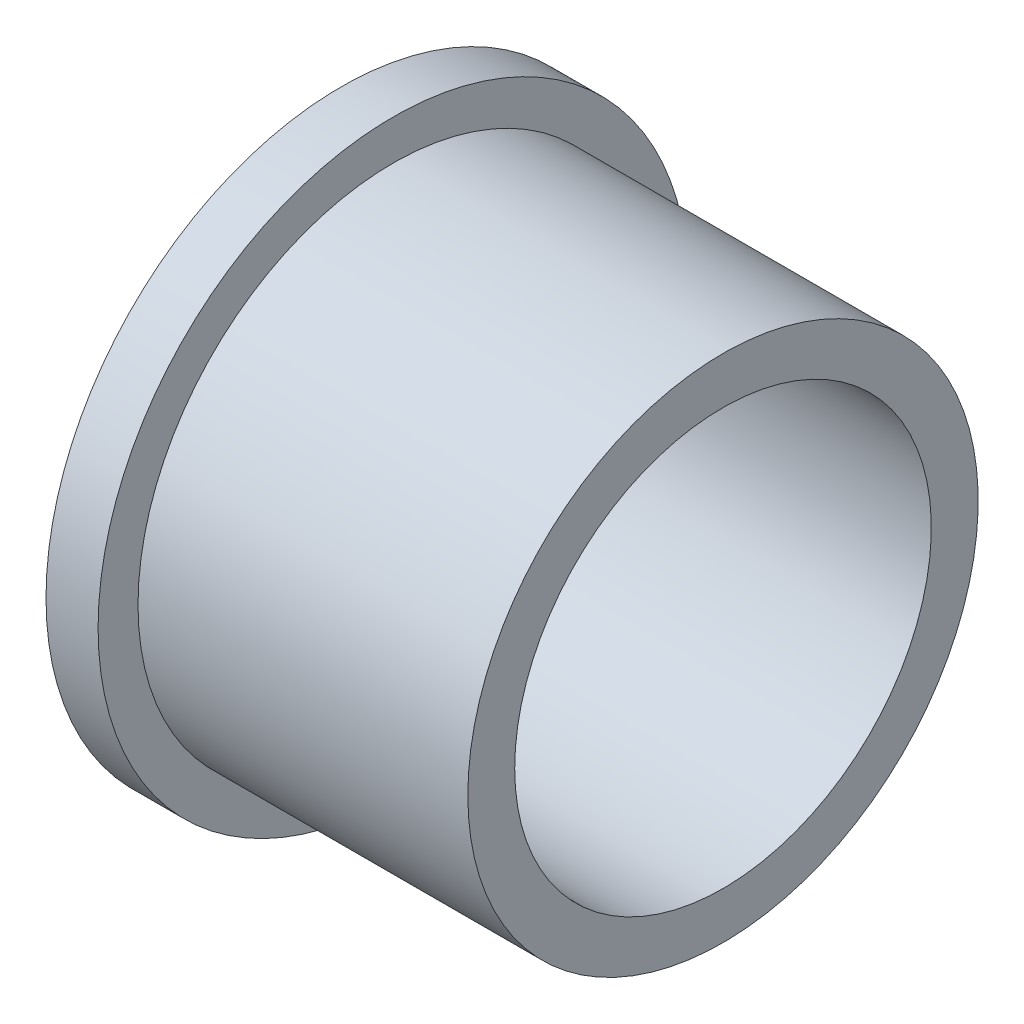
ISO-10303-21;
HEADER;
FILE_DESCRIPTION(('STEP AP214'),'2;1');
FILE_NAME('part.step','',(''),(''),'','','');
FILE_SCHEMA(('AUTOMOTIVE_DESIGN { 1 0 10303 214 1 1 1 1 }'));
ENDSEC;
DATA;
#1=APPLICATION_CONTEXT('core data for automotive mechanical design processes');
#2=APPLICATION_PROTOCOL_DEFINITION('international standard','automotive_design',2000,#1);
#3=PRODUCT_CONTEXT('',#1,'mechanical');
#4=PRODUCT('Part','Part','',(#3));
#5=PRODUCT_RELATED_PRODUCT_CATEGORY('part','',(#4));
#6=PRODUCT_DEFINITION_FORMATION('','',#4);
#7=PRODUCT_DEFINITION_CONTEXT('part definition',#1,'design');
#8=PRODUCT_DEFINITION('design','',#6,#7);
#9=PRODUCT_DEFINITION_SHAPE('','',#8);
#10=(LENGTH_UNIT() NAMED_UNIT(*) SI_UNIT(.MILLI.,.METRE.));
#11=(NAMED_UNIT(*) PLANE_ANGLE_UNIT() SI_UNIT($,.RADIAN.));
#12=(NAMED_UNIT(*) SI_UNIT($,.STERADIAN.) SOLID_ANGLE_UNIT());
#13=UNCERTAINTY_MEASURE_WITH_UNIT(LENGTH_MEASURE(1.E-05),#10,'distance_accuracy_value','');
#14=(GEOMETRIC_REPRESENTATION_CONTEXT(3) GLOBAL_UNCERTAINTY_ASSIGNED_CONTEXT((#13)) GLOBAL_UNIT_ASSIGNED_CONTEXT((#10,
#11,#12)) REPRESENTATION_CONTEXT('',''));
#15=CARTESIAN_POINT('',(0.,0.,0.));
#16=DIRECTION('',(0.,0.,1.));
#17=DIRECTION('',(1.,0.,0.));
#18=AXIS2_PLACEMENT_3D('',#15,#16,#17);
#19=CARTESIAN_POINT('',(-1.5,6.,0.));
#20=DIRECTION('',(1.,0.,0.));
#21=DIRECTION('',(0.,0.,-1.));
#22=AXIS2_PLACEMENT_3D('',#19,#20,#21);
#23=PLANE('',#22);
#24=CARTESIAN_POINT('',(-1.5,0.,0.));
#25=DIRECTION('',(-1.,0.,0.));
#26=DIRECTION('',(0.,0.,1.));
#27=AXIS2_PLACEMENT_3D('',#24,#25,#26);
#28=CIRCLE('',#27,6.);
#29=CARTESIAN_POINT('',(-1.5,0.,6.));
#30=VERTEX_POINT('',#29);
#31=EDGE_CURVE('E10',#30,#30,#28,.T.);
#32=ORIENTED_EDGE('',*,*,#31,.F.);
#33=EDGE_LOOP('',(#32));
#34=FACE_BOUND('',#33,.T.);
#35=CARTESIAN_POINT('',(-1.5,0.,0.));
#36=DIRECTION('',(-1.,0.,0.));
#37=DIRECTION('',(0.,0.,1.));
#38=AXIS2_PLACEMENT_3D('',#35,#36,#37);
#39=CIRCLE('',#38,8.5);
#40=CARTESIAN_POINT('',(-1.5,0.,8.5));
#41=VERTEX_POINT('',#40);
#42=EDGE_CURVE('E51',#41,#41,#39,.T.);
#43=ORIENTED_EDGE('',*,*,#42,.T.);
#44=EDGE_LOOP('',(#43));
#45=FACE_BOUND('',#44,.T.);
#46=ADVANCED_FACE('F29',(#34,#45),#23,.F.);
#47=CARTESIAN_POINT('',(0.,0.,0.));
#48=DIRECTION('',(-1.,0.,0.));
#49=DIRECTION('',(0.,0.,1.));
#50=AXIS2_PLACEMENT_3D('',#47,#48,#49);
#51=CYLINDRICAL_SURFACE('',#50,6.);
#52=CARTESIAN_POINT('',(9.5,0.,0.));
#53=DIRECTION('',(-1.,0.,0.));
#54=DIRECTION('',(0.,0.,1.));
#55=AXIS2_PLACEMENT_3D('',#52,#53,#54);
#56=CIRCLE('',#55,6.);
#57=CARTESIAN_POINT('',(9.5,0.,6.));
#58=VERTEX_POINT('',#57);
#59=EDGE_CURVE('E35',#58,#58,#56,.T.);
#60=ORIENTED_EDGE('',*,*,#59,.F.);
#61=EDGE_LOOP('',(#60));
#62=FACE_BOUND('',#61,.T.);
#63=ORIENTED_EDGE('',*,*,#31,.T.);
#64=EDGE_LOOP('',(#63));
#65=FACE_BOUND('',#64,.T.);
#66=ADVANCED_FACE('F76',(#62,#65),#51,.F.);
#67=CARTESIAN_POINT('',(9.5,6.,0.));
#68=DIRECTION('',(-1.,0.,0.));
#69=DIRECTION('',(0.,0.,1.));
#70=AXIS2_PLACEMENT_3D('',#67,#68,#69);
#71=PLANE('',#70);
#72=CARTESIAN_POINT('',(9.5,0.,0.));
#73=DIRECTION('',(-1.,0.,0.));
#74=DIRECTION('',(0.,0.,1.));
#75=AXIS2_PLACEMENT_3D('',#72,#73,#74);
#76=CIRCLE('',#75,7.35);
#77=CARTESIAN_POINT('',(9.5,0.,7.35));
#78=VERTEX_POINT('',#77);
#79=EDGE_CURVE('E39',#78,#78,#76,.T.);
#80=ORIENTED_EDGE('',*,*,#79,.F.);
#81=EDGE_LOOP('',(#80));
#82=FACE_BOUND('',#81,.T.);
#83=ORIENTED_EDGE('',*,*,#59,.T.);
#84=EDGE_LOOP('',(#83));
#85=FACE_BOUND('',#84,.T.);
#86=ADVANCED_FACE('F71',(#82,#85),#71,.F.);
#87=CARTESIAN_POINT('',(0.,0.,0.));
#88=DIRECTION('',(-1.,0.,0.));
#89=DIRECTION('',(0.,0.,1.));
#90=AXIS2_PLACEMENT_3D('',#87,#88,#89);
#91=CYLINDRICAL_SURFACE('',#90,7.35);
#92=CARTESIAN_POINT('',(0.,0.,0.));
#93=DIRECTION('',(-1.,0.,0.));
#94=DIRECTION('',(0.,0.,1.));
#95=AXIS2_PLACEMENT_3D('',#92,#93,#94);
#96=CIRCLE('',#95,7.35);
#97=CARTESIAN_POINT('',(0.,0.,7.35));
#98=VERTEX_POINT('',#97);
#99=EDGE_CURVE('E43',#98,#98,#96,.T.);
#100=ORIENTED_EDGE('',*,*,#99,.F.);
#101=EDGE_LOOP('',(#100));
#102=FACE_BOUND('',#101,.T.);
#103=ORIENTED_EDGE('',*,*,#79,.T.);
#104=EDGE_LOOP('',(#103));
#105=FACE_BOUND('',#104,.T.);
#106=ADVANCED_FACE('F65',(#102,#105),#91,.T.);
#107=CARTESIAN_POINT('',(0.,8.5,0.));
#108=DIRECTION('',(-1.,0.,0.));
#109=DIRECTION('',(0.,0.,1.));
#110=AXIS2_PLACEMENT_3D('',#107,#108,#109);
#111=PLANE('',#110);
#112=CARTESIAN_POINT('',(0.,0.,0.));
#113=DIRECTION('',(-1.,0.,0.));
#114=DIRECTION('',(0.,0.,1.));
#115=AXIS2_PLACEMENT_3D('',#112,#113,#114);
#116=CIRCLE('',#115,8.5);
#117=CARTESIAN_POINT('',(0.,0.,8.5));
#118=VERTEX_POINT('',#117);
#119=EDGE_CURVE('E48',#118,#118,#116,.T.);
#120=ORIENTED_EDGE('',*,*,#119,.F.);
#121=EDGE_LOOP('',(#120));
#122=FACE_BOUND('',#121,.T.);
#123=ORIENTED_EDGE('',*,*,#99,.T.);
#124=EDGE_LOOP('',(#123));
#125=FACE_BOUND('',#124,.T.);
#126=ADVANCED_FACE('F59',(#122,#125),#111,.F.);
#127=CARTESIAN_POINT('',(0.,0.,0.));
#128=DIRECTION('',(-1.,0.,0.));
#129=DIRECTION('',(0.,0.,1.));
#130=AXIS2_PLACEMENT_3D('',#127,#128,#129);
#131=CYLINDRICAL_SURFACE('',#130,8.5);
#132=ORIENTED_EDGE('',*,*,#42,.F.);
#133=EDGE_LOOP('',(#132));
#134=FACE_BOUND('',#133,.T.);
#135=ORIENTED_EDGE('',*,*,#119,.T.);
#136=EDGE_LOOP('',(#135));
#137=FACE_BOUND('',#136,.T.);
#138=ADVANCED_FACE('F56',(#134,#137),#131,.T.);
#139=CLOSED_SHELL('',(#46,#66,#86,#106,#126,#138));
#140=MANIFOLD_SOLID_BREP('B2',#139);
#141=ADVANCED_BREP_SHAPE_REPRESENTATION('',(#18,#140),#14);
#142=SHAPE_DEFINITION_REPRESENTATION(#9,#141);
ENDSEC;
END-ISO-10303-21;
